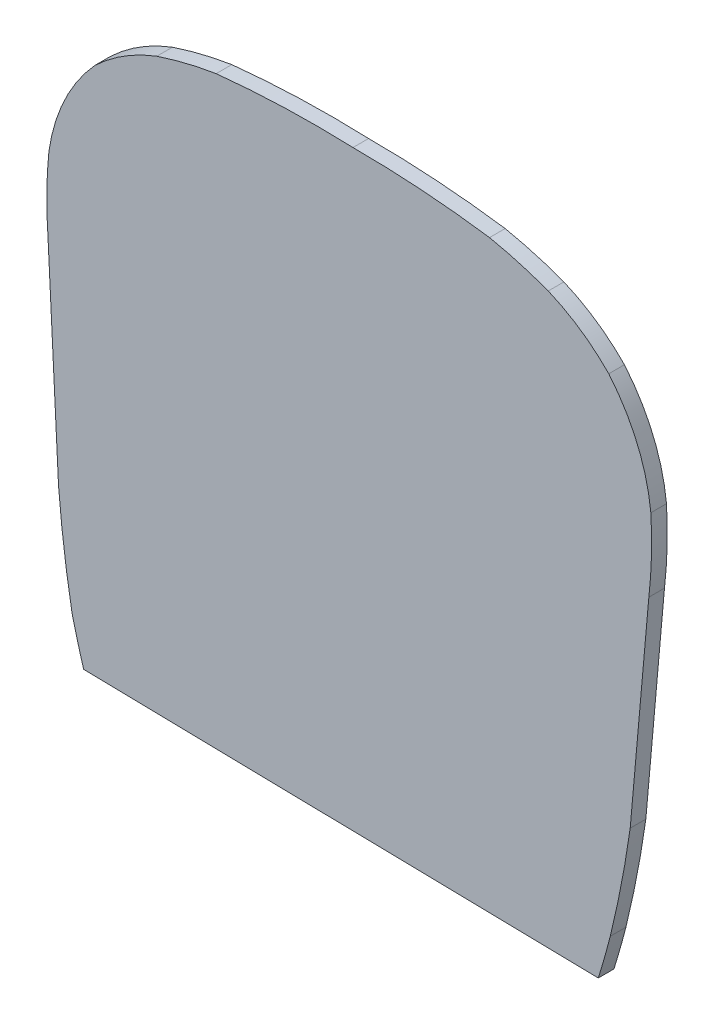
ISO-10303-21;
HEADER;
FILE_DESCRIPTION(('STEP AP214'),'2;1');
FILE_NAME('part.step','',(''),(''),'','','');
FILE_SCHEMA(('AUTOMOTIVE_DESIGN { 1 0 10303 214 1 1 1 1 }'));
ENDSEC;
DATA;
#1=APPLICATION_CONTEXT('core data for automotive mechanical design processes');
#2=APPLICATION_PROTOCOL_DEFINITION('international standard','automotive_design',2000,#1);
#3=PRODUCT_CONTEXT('',#1,'mechanical');
#4=PRODUCT('Part','Part','',(#3));
#5=PRODUCT_RELATED_PRODUCT_CATEGORY('part','',(#4));
#6=PRODUCT_DEFINITION_FORMATION('','',#4);
#7=PRODUCT_DEFINITION_CONTEXT('part definition',#1,'design');
#8=PRODUCT_DEFINITION('design','',#6,#7);
#9=PRODUCT_DEFINITION_SHAPE('','',#8);
#10=(LENGTH_UNIT() NAMED_UNIT(*) SI_UNIT(.MILLI.,.METRE.));
#11=(NAMED_UNIT(*) PLANE_ANGLE_UNIT() SI_UNIT($,.RADIAN.));
#12=(NAMED_UNIT(*) SI_UNIT($,.STERADIAN.) SOLID_ANGLE_UNIT());
#13=UNCERTAINTY_MEASURE_WITH_UNIT(LENGTH_MEASURE(1.E-05),#10,'distance_accuracy_value','');
#14=(GEOMETRIC_REPRESENTATION_CONTEXT(3) GLOBAL_UNCERTAINTY_ASSIGNED_CONTEXT((#13)) GLOBAL_UNIT_ASSIGNED_CONTEXT((#10,
#11,#12)) REPRESENTATION_CONTEXT('',''));
#15=CARTESIAN_POINT('',(0.,0.,0.));
#16=DIRECTION('',(0.,0.,1.));
#17=DIRECTION('',(1.,0.,0.));
#18=AXIS2_PLACEMENT_3D('',#15,#16,#17);
#19=CARTESIAN_POINT('',(-5.67417224383373,6.99934325123754,45.8150965279296));
#20=DIRECTION('',(0.,0.,1.));
#21=DIRECTION('',(-0.999812677663925,0.0193548335692306,0.));
#22=AXIS2_PLACEMENT_3D('',#19,#20,#21);
#23=PLANE('',#22);
#24=CARTESIAN_POINT('',(0.530056286970287,1.01824527478446,45.8150965279299));
#25=DIRECTION('',(0.,0.,-1.));
#26=DIRECTION('',(0.999812677663925,-0.0193548335692306,0.));
#27=AXIS2_PLACEMENT_3D('',#24,#25,#26);
#28=CIRCLE('',#27,12.0325225140272);
#29=CARTESIAN_POINT('',(2.90017532436274,12.8150301672525,45.8150965279298));
#30=VERTEX_POINT('',#29);
#31=CARTESIAN_POINT('',(4.78161682306448,12.2746137415013,45.8150965279299));
#32=VERTEX_POINT('',#31);
#33=EDGE_CURVE('E252',#30,#32,#28,.T.);
#34=ORIENTED_EDGE('',*,*,#33,.F.);
#35=CARTESIAN_POINT('',(-1.48641653317343,-17.9871033769043,45.8150965279301));
#36=DIRECTION('',(0.,0.,-1.));
#37=DIRECTION('',(0.999812677663925,-0.0193548335692306,0.));
#38=AXIS2_PLACEMENT_3D('',#35,#36,#37);
#39=CIRCLE('',#38,31.1129172370042);
#40=CARTESIAN_POINT('',(-1.47338446078643,13.1258111307685,45.8150965279297));
#41=VERTEX_POINT('',#40);
#42=EDGE_CURVE('E248',#41,#30,#39,.T.);
#43=ORIENTED_EDGE('',*,*,#42,.F.);
#44=CARTESIAN_POINT('',(-2.66450711215649,-17.9642973237393,45.8150965279301));
#45=DIRECTION('',(0.,0.,-1.));
#46=DIRECTION('',(0.999812677663925,-0.0193548335692306,0.));
#47=AXIS2_PLACEMENT_3D('',#44,#45,#46);
#48=CIRCLE('',#47,31.1129172030472);
#49=CARTESIAN_POINT('',(-5.85569546522282,12.9845303403083,45.8150965279296));
#50=VERTEX_POINT('',#49);
#51=EDGE_CURVE('E243',#50,#41,#48,.T.);
#52=ORIENTED_EDGE('',*,*,#51,.F.);
#53=CARTESIAN_POINT('',(-3.94391624226271,1.10485449232203,45.8150965279298));
#54=DIRECTION('',(0.,0.,-1.));
#55=DIRECTION('',(0.999812677663925,-0.0193548335692306,0.));
#56=AXIS2_PLACEMENT_3D('',#53,#54,#55);
#57=CIRCLE('',#56,12.0325225140272);
#58=CARTESIAN_POINT('',(-7.75664277320113,12.5173351363735,45.8150965279295));
#59=VERTEX_POINT('',#58);
#60=EDGE_CURVE('E238',#59,#50,#57,.T.);
#61=ORIENTED_EDGE('',*,*,#60,.F.);
#62=CARTESIAN_POINT('',(-5.67417224383373,6.99934325123754,45.8150965279296));
#63=DIRECTION('',(0.,0.,-1.));
#64=DIRECTION('',(0.999812677663925,-0.0193548335692306,0.));
#65=AXIS2_PLACEMENT_3D('',#62,#63,#64);
#66=CIRCLE('',#65,5.8978740195184);
#67=CARTESIAN_POINT('',(-9.74550957704439,11.2665590026749,45.8150965279295));
#68=VERTEX_POINT('',#67);
#69=EDGE_CURVE('E233',#68,#59,#66,.T.);
#70=ORIENTED_EDGE('',*,*,#69,.F.);
#71=CARTESIAN_POINT('',(-5.42512198701847,7.3272075898744,45.8150965279296));
#72=DIRECTION('',(0.,0.,-1.));
#73=DIRECTION('',(0.999812677663925,-0.0193548335692306,0.));
#74=AXIS2_PLACEMENT_3D('',#71,#72,#73);
#75=CIRCLE('',#74,5.846728870196);
#76=CARTESIAN_POINT('',(-11.2152036833306,8.13911425422368,45.8150965279295));
#77=VERTEX_POINT('',#76);
#78=EDGE_CURVE('E228',#77,#68,#75,.T.);
#79=ORIENTED_EDGE('',*,*,#78,.F.);
#80=CARTESIAN_POINT('',(2.30368448001543,6.79226722780302,45.8150965279299));
#81=DIRECTION('',(0.,0.,-1.));
#82=DIRECTION('',(0.999812677663925,-0.0193548335692306,0.));
#83=AXIS2_PLACEMENT_3D('',#80,#81,#82);
#84=CIRCLE('',#83,13.5858137071592);
#85=CARTESIAN_POINT('',(-11.2430688844002,5.76279776767875,45.8150965279295));
#86=VERTEX_POINT('',#85);
#87=EDGE_CURVE('E136',#86,#77,#84,.T.);
#88=ORIENTED_EDGE('',*,*,#87,.F.);
#89=DIRECTION('',(0.0500831809567751,-0.998745050042928,0.));
#90=VECTOR('',#89,1.);
#91=CARTESIAN_POINT('',(-10.9057934577918,-0.963056229434312,45.8150965279296));
#92=LINE('',#91,#90);
#93=CARTESIAN_POINT('',(-10.9057934577918,-0.963056229434231,45.8150965279296));
#94=VERTEX_POINT('',#93);
#95=EDGE_CURVE('E135',#94,#86,#92,.F.);
#96=ORIENTED_EDGE('',*,*,#95,.F.);
#97=CARTESIAN_POINT('',(22.6796627220154,1.7211664776255,45.8150965279306));
#98=DIRECTION('',(0.,0.,-1.));
#99=DIRECTION('',(0.999812677663925,-0.0193548335692306,0.));
#100=AXIS2_PLACEMENT_3D('',#97,#98,#99);
#101=CIRCLE('',#100,33.6925498938096);
#102=CARTESIAN_POINT('',(-10.4707169958812,-4.29882047469555,45.8150965279296));
#103=VERTEX_POINT('',#102);
#104=EDGE_CURVE('E20',#103,#94,#101,.T.);
#105=ORIENTED_EDGE('',*,*,#104,.F.);
#106=CARTESIAN_POINT('',(17.1662588400598,2.46523412556552,45.8150965279304));
#107=DIRECTION('',(0.,0.,-1.));
#108=DIRECTION('',(0.999812677663925,-0.0193548335692306,0.));
#109=AXIS2_PLACEMENT_3D('',#106,#107,#108);
#110=CIRCLE('',#109,28.4526776945808);
#111=CARTESIAN_POINT('',(-10.1003556820076,-5.6641324239686,45.8150965279297));
#112=VERTEX_POINT('',#111);
#113=EDGE_CURVE('E278',#112,#103,#110,.T.);
#114=ORIENTED_EDGE('',*,*,#113,.F.);
#115=DIRECTION('',(0.999812677663925,-0.0193548335692306,0.));
#116=VECTOR('',#115,1.);
#117=CARTESIAN_POINT('',(6.38510731119488,-5.98326559728529,45.8150965279302));
#118=LINE('',#117,#116);
#119=CARTESIAN_POINT('',(6.38510731119487,-5.98326559728529,45.8150965279302));
#120=VERTEX_POINT('',#119);
#121=EDGE_CURVE('E168',#120,#112,#118,.F.);
#122=ORIENTED_EDGE('',*,*,#121,.F.);
#123=CARTESIAN_POINT('',(-20.7843012620732,2.46529083387636,45.8150965279292));
#124=DIRECTION('',(0.,0.,-1.));
#125=DIRECTION('',(0.999812677663925,-0.0193548335692306,0.));
#126=AXIS2_PLACEMENT_3D('',#123,#124,#125);
#127=CIRCLE('',#126,28.4526776945808);
#128=CARTESIAN_POINT('',(6.76871470810026,-4.63303142839532,45.8150965279302));
#129=VERTEX_POINT('',#128);
#130=EDGE_CURVE('E275',#129,#120,#127,.T.);
#131=ORIENTED_EDGE('',*,*,#130,.F.);
#132=CARTESIAN_POINT('',(-25.9566044322497,3.38204221500296,45.8150965279291));
#133=DIRECTION('',(0.,0.,-1.));
#134=DIRECTION('',(0.999812677663925,-0.0193548335692306,0.));
#135=AXIS2_PLACEMENT_3D('',#132,#133,#134);
#136=CIRCLE('',#135,33.6925498938096);
#137=CARTESIAN_POINT('',(7.40687411566913,-1.31542705359407,45.8150965279302));
#138=VERTEX_POINT('',#137);
#139=EDGE_CURVE('E270',#138,#129,#136,.T.);
#140=ORIENTED_EDGE('',*,*,#139,.F.);
#141=DIRECTION('',(0.0886995040357044,0.996058431008854,0.));
#142=VECTOR('',#141,1.);
#143=CARTESIAN_POINT('',(8.00401392218934,5.39020388810814,45.8150965279301));
#144=LINE('',#143,#142);
#145=CARTESIAN_POINT('',(8.00401392218934,5.39020388810806,45.8150965279301));
#146=VERTEX_POINT('',#145);
#147=EDGE_CURVE('E162',#146,#138,#144,.F.);
#148=ORIENTED_EDGE('',*,*,#147,.F.);
#149=CARTESIAN_POINT('',(-5.49274699972552,6.94319413350787,45.8150965279296));
#150=DIRECTION('',(0.,0.,-1.));
#151=DIRECTION('',(0.999812677663925,-0.0193548335692306,0.));
#152=AXIS2_PLACEMENT_3D('',#149,#150,#151);
#153=CIRCLE('',#152,13.5858137071592);
#154=CARTESIAN_POINT('',(8.06813878736105,7.76581844340164,45.8150965279301));
#155=VERTEX_POINT('',#154);
#156=EDGE_CURVE('E267',#155,#146,#153,.T.);
#157=ORIENTED_EDGE('',*,*,#156,.F.);
#158=CARTESIAN_POINT('',(2.25097238178384,7.17861022529906,45.8150965279299));
#159=DIRECTION('',(0.,0.,-1.));
#160=DIRECTION('',(0.999812677663925,-0.0193548335692306,0.));
#161=AXIS2_PLACEMENT_3D('',#158,#159,#160);
#162=CIRCLE('',#161,5.846728870196);
#163=CARTESIAN_POINT('',(6.72058547159109,10.9478007629354,45.81509652793));
#164=VERTEX_POINT('',#163);
#165=EDGE_CURVE('E262',#164,#155,#162,.T.);
#166=ORIENTED_EDGE('',*,*,#165,.F.);
#167=CARTESIAN_POINT('',(2.48714690336352,6.84135268227571,45.8150965279299));
#168=DIRECTION('',(0.,0.,-1.));
#169=DIRECTION('',(0.999812677663925,-0.0193548335692306,0.));
#170=AXIS2_PLACEMENT_3D('',#167,#168,#169);
#171=CIRCLE('',#170,5.8978740195184);
#172=EDGE_CURVE('E257',#32,#164,#171,.T.);
#173=ORIENTED_EDGE('',*,*,#172,.F.);
#174=EDGE_LOOP('',(#34,#43,#52,#61,#70,#79,#88,#96,#105,#114,#122,#131,#140,#148,#157,#166,#173));
#175=FACE_BOUND('',#174,.T.);
#176=ADVANCED_FACE('F17',(#175),#23,.T.);
#177=CARTESIAN_POINT('',(-10.9057934577918,-0.963056229434297,46.8472492910314));
#178=DIRECTION('',(-0.998745050042928,-0.0500831809567751,0.));
#179=DIRECTION('',(0.0500831809567751,-0.998745050042928,0.));
#180=AXIS2_PLACEMENT_3D('',#177,#178,#179);
#181=PLANE('',#180);
#182=DIRECTION('',(0.,0.,-1.));
#183=VECTOR('',#182,1.);
#184=CARTESIAN_POINT('',(-10.9057934577918,-0.963056229434226,46.8472492910314));
#185=LINE('',#184,#183);
#186=CARTESIAN_POINT('',(-10.9057934577918,-0.963056229434252,45.3140965279296));
#187=VERTEX_POINT('',#186);
#188=EDGE_CURVE('E142',#94,#187,#185,.T.);
#189=ORIENTED_EDGE('',*,*,#188,.F.);
#190=ORIENTED_EDGE('',*,*,#95,.T.);
#191=DIRECTION('',(0.,0.,-1.));
#192=VECTOR('',#191,1.);
#193=CARTESIAN_POINT('',(-11.2430688844002,5.76279776767878,46.8472492910314));
#194=LINE('',#193,#192);
#195=CARTESIAN_POINT('',(-11.2430688844002,5.76279776767882,45.3140965279295));
#196=VERTEX_POINT('',#195);
#197=EDGE_CURVE('E227',#196,#86,#194,.F.);
#198=ORIENTED_EDGE('',*,*,#197,.F.);
#199=DIRECTION('',(0.050083180956776,-0.998745050042928,0.));
#200=VECTOR('',#199,1.);
#201=CARTESIAN_POINT('',(-11.2430688844002,5.76279776767876,45.3140965279295));
#202=LINE('',#201,#200);
#203=EDGE_CURVE('E154',#196,#187,#202,.T.);
#204=ORIENTED_EDGE('',*,*,#203,.T.);
#205=EDGE_LOOP('',(#189,#190,#198,#204));
#206=FACE_BOUND('',#205,.T.);
#207=ADVANCED_FACE('F152',(#206),#181,.T.);
#208=CARTESIAN_POINT('',(22.6796627220154,1.72116647762551,46.8472492910325));
#209=DIRECTION('',(0.,0.,-1.));
#210=DIRECTION('',(0.999812677663925,-0.0193548335692306,0.));
#211=AXIS2_PLACEMENT_3D('',#208,#209,#210);
#212=CYLINDRICAL_SURFACE('',#211,33.6925498938096);
#213=DIRECTION('',(0.,0.,-1.));
#214=VECTOR('',#213,1.);
#215=CARTESIAN_POINT('',(-10.4707169958812,-4.29882047469553,46.8472492910315));
#216=LINE('',#215,#214);
#217=CARTESIAN_POINT('',(-10.4707169958812,-4.29882047469555,45.3140965279297));
#218=VERTEX_POINT('',#217);
#219=EDGE_CURVE('E149',#103,#218,#216,.T.);
#220=ORIENTED_EDGE('',*,*,#219,.F.);
#221=ORIENTED_EDGE('',*,*,#104,.T.);
#222=ORIENTED_EDGE('',*,*,#188,.T.);
#223=CARTESIAN_POINT('',(22.6796627220154,1.72116647762549,45.3140965279306));
#224=DIRECTION('',(0.,0.,-1.));
#225=DIRECTION('',(0.999812677663925,-0.0193548335692306,0.));
#226=AXIS2_PLACEMENT_3D('',#223,#224,#225);
#227=CIRCLE('',#226,33.6925498938096);
#228=EDGE_CURVE('E222',#187,#218,#227,.F.);
#229=ORIENTED_EDGE('',*,*,#228,.T.);
#230=EDGE_LOOP('',(#220,#221,#222,#229));
#231=FACE_BOUND('',#230,.T.);
#232=ADVANCED_FACE('F146',(#231),#212,.T.);
#233=CARTESIAN_POINT('',(17.1662588400597,2.46523412556554,46.8472492910323));
#234=DIRECTION('',(0.,0.,-1.));
#235=DIRECTION('',(0.999812677663925,-0.0193548335692306,0.));
#236=AXIS2_PLACEMENT_3D('',#233,#234,#235);
#237=CYLINDRICAL_SURFACE('',#236,28.4526776945808);
#238=DIRECTION('',(0.,0.,1.));
#239=VECTOR('',#238,1.);
#240=CARTESIAN_POINT('',(-10.1003556820076,-5.66413242396858,46.8472492910315));
#241=LINE('',#240,#239);
#242=CARTESIAN_POINT('',(-10.1003556820075,-5.66413242396861,45.3140965279297));
#243=VERTEX_POINT('',#242);
#244=EDGE_CURVE('E172',#112,#243,#241,.F.);
#245=ORIENTED_EDGE('',*,*,#244,.F.);
#246=ORIENTED_EDGE('',*,*,#113,.T.);
#247=ORIENTED_EDGE('',*,*,#219,.T.);
#248=CARTESIAN_POINT('',(17.1662588400598,2.46523412556551,45.3140965279305));
#249=DIRECTION('',(0.,0.,-1.));
#250=DIRECTION('',(0.999812677663925,-0.0193548335692306,0.));
#251=AXIS2_PLACEMENT_3D('',#248,#249,#250);
#252=CIRCLE('',#251,28.4526776945808);
#253=EDGE_CURVE('E218',#218,#243,#252,.F.);
#254=ORIENTED_EDGE('',*,*,#253,.T.);
#255=EDGE_LOOP('',(#245,#246,#247,#254));
#256=FACE_BOUND('',#255,.T.);
#257=ADVANCED_FACE('F286',(#256),#237,.T.);
#258=CARTESIAN_POINT('',(6.38510731119485,-5.98326559728527,46.8472492910321));
#259=DIRECTION('',(-0.0193548335692306,-0.999812677663925,0.));
#260=DIRECTION('',(0.999812677663925,-0.0193548335692306,0.));
#261=AXIS2_PLACEMENT_3D('',#258,#259,#260);
#262=PLANE('',#261);
#263=DIRECTION('',(0.,0.,-1.));
#264=VECTOR('',#263,1.);
#265=CARTESIAN_POINT('',(6.38510731119484,-5.98326559728527,46.8472492910321));
#266=LINE('',#265,#264);
#267=CARTESIAN_POINT('',(6.38510731119489,-5.98326559728529,45.3140965279302));
#268=VERTEX_POINT('',#267);
#269=EDGE_CURVE('E171',#120,#268,#266,.T.);
#270=ORIENTED_EDGE('',*,*,#269,.F.);
#271=ORIENTED_EDGE('',*,*,#121,.T.);
#272=ORIENTED_EDGE('',*,*,#244,.T.);
#273=DIRECTION('',(-0.999812677663925,0.0193548335692306,0.));
#274=VECTOR('',#273,1.);
#275=CARTESIAN_POINT('',(-2.42926960316287,-5.81263283576393,45.3140965279299));
#276=LINE('',#275,#274);
#277=EDGE_CURVE('E217',#243,#268,#276,.F.);
#278=ORIENTED_EDGE('',*,*,#277,.T.);
#279=EDGE_LOOP('',(#270,#271,#272,#278));
#280=FACE_BOUND('',#279,.T.);
#281=ADVANCED_FACE('F332',(#280),#262,.T.);
#282=CARTESIAN_POINT('',(-20.7843012620732,2.46529083387637,46.8472492910311));
#283=DIRECTION('',(0.,0.,-1.));
#284=DIRECTION('',(0.999812677663925,-0.0193548335692306,0.));
#285=AXIS2_PLACEMENT_3D('',#282,#283,#284);
#286=CYLINDRICAL_SURFACE('',#285,28.4526776945808);
#287=DIRECTION('',(0.,0.,-1.));
#288=VECTOR('',#287,1.);
#289=CARTESIAN_POINT('',(6.76871470810022,-4.63303142839535,46.8472492910321));
#290=LINE('',#289,#288);
#291=CARTESIAN_POINT('',(6.76871470810029,-4.63303142839528,45.3140965279302));
#292=VERTEX_POINT('',#291);
#293=EDGE_CURVE('E274',#129,#292,#290,.T.);
#294=ORIENTED_EDGE('',*,*,#293,.F.);
#295=ORIENTED_EDGE('',*,*,#130,.T.);
#296=ORIENTED_EDGE('',*,*,#269,.T.);
#297=CARTESIAN_POINT('',(-20.7843012620732,2.46529083387635,45.3140965279292));
#298=DIRECTION('',(0.,0.,-1.));
#299=DIRECTION('',(0.999812677663925,-0.0193548335692306,0.));
#300=AXIS2_PLACEMENT_3D('',#297,#298,#299);
#301=CIRCLE('',#300,28.4526776945808);
#302=EDGE_CURVE('E213',#268,#292,#301,.F.);
#303=ORIENTED_EDGE('',*,*,#302,.T.);
#304=EDGE_LOOP('',(#294,#295,#296,#303));
#305=FACE_BOUND('',#304,.T.);
#306=ADVANCED_FACE('F331',(#305),#286,.T.);
#307=CARTESIAN_POINT('',(-25.9566044322497,3.38204221500297,46.8472492910309));
#308=DIRECTION('',(0.,0.,-1.));
#309=DIRECTION('',(0.999812677663925,-0.0193548335692306,0.));
#310=AXIS2_PLACEMENT_3D('',#307,#308,#309);
#311=CYLINDRICAL_SURFACE('',#310,33.6925498938096);
#312=DIRECTION('',(0.,0.,1.));
#313=VECTOR('',#312,1.);
#314=CARTESIAN_POINT('',(7.40687411566909,-1.31542705359407,46.847249291032));
#315=LINE('',#314,#313);
#316=CARTESIAN_POINT('',(7.40687411566913,-1.31542705359414,45.3140965279302));
#317=VERTEX_POINT('',#316);
#318=EDGE_CURVE('E167',#138,#317,#315,.F.);
#319=ORIENTED_EDGE('',*,*,#318,.F.);
#320=ORIENTED_EDGE('',*,*,#139,.T.);
#321=ORIENTED_EDGE('',*,*,#293,.T.);
#322=CARTESIAN_POINT('',(-25.9566044322497,3.38204221500295,45.3140965279291));
#323=DIRECTION('',(0.,0.,-1.));
#324=DIRECTION('',(0.999812677663925,-0.0193548335692306,0.));
#325=AXIS2_PLACEMENT_3D('',#322,#323,#324);
#326=CIRCLE('',#325,33.6925498938096);
#327=EDGE_CURVE('E209',#292,#317,#326,.F.);
#328=ORIENTED_EDGE('',*,*,#327,.T.);
#329=EDGE_LOOP('',(#319,#320,#321,#328));
#330=FACE_BOUND('',#329,.T.);
#331=ADVANCED_FACE('F336',(#330),#311,.T.);
#332=CARTESIAN_POINT('',(8.00401392218931,5.39020388810815,46.847249291032));
#333=DIRECTION('',(0.996058431008854,-0.0886995040357044,0.));
#334=DIRECTION('',(0.0886995040357044,0.996058431008854,0.));
#335=AXIS2_PLACEMENT_3D('',#332,#333,#334);
#336=PLANE('',#335);
#337=DIRECTION('',(0.,0.,-1.));
#338=VECTOR('',#337,1.);
#339=CARTESIAN_POINT('',(8.00401392218931,5.39020388810814,46.847249291032));
#340=LINE('',#339,#338);
#341=CARTESIAN_POINT('',(8.00401392218936,5.3902038881081,45.3140965279301));
#342=VERTEX_POINT('',#341);
#343=EDGE_CURVE('E166',#146,#342,#340,.T.);
#344=ORIENTED_EDGE('',*,*,#343,.F.);
#345=ORIENTED_EDGE('',*,*,#147,.T.);
#346=ORIENTED_EDGE('',*,*,#318,.T.);
#347=DIRECTION('',(0.0886995040357049,0.996058431008854,0.));
#348=VECTOR('',#347,1.);
#349=CARTESIAN_POINT('',(7.40687411566913,-1.31542705359416,45.3140965279302));
#350=LINE('',#349,#348);
#351=EDGE_CURVE('E208',#317,#342,#350,.T.);
#352=ORIENTED_EDGE('',*,*,#351,.T.);
#353=EDGE_LOOP('',(#344,#345,#346,#352));
#354=FACE_BOUND('',#353,.T.);
#355=ADVANCED_FACE('F341',(#354),#336,.T.);
#356=CARTESIAN_POINT('',(-5.49274699972555,6.94319413350788,46.8472492910315));
#357=DIRECTION('',(0.,0.,-1.));
#358=DIRECTION('',(0.999812677663925,-0.0193548335692306,0.));
#359=AXIS2_PLACEMENT_3D('',#356,#357,#358);
#360=CYLINDRICAL_SURFACE('',#359,13.5858137071592);
#361=CARTESIAN_POINT('',(-5.4927469997255,6.94319413350786,45.3140965279297));
#362=DIRECTION('',(0.,0.,-1.));
#363=DIRECTION('',(0.999812677663925,-0.0193548335692306,0.));
#364=AXIS2_PLACEMENT_3D('',#361,#362,#363);
#365=CIRCLE('',#364,13.5858137071592);
#366=CARTESIAN_POINT('',(8.06813878736107,7.76581844340164,45.3140965279301));
#367=VERTEX_POINT('',#366);
#368=EDGE_CURVE('E205',#342,#367,#365,.F.);
#369=ORIENTED_EDGE('',*,*,#368,.T.);
#370=DIRECTION('',(0.,0.,-1.));
#371=VECTOR('',#370,1.);
#372=CARTESIAN_POINT('',(8.06813878736102,7.76581844340167,46.8472492910319));
#373=LINE('',#372,#371);
#374=EDGE_CURVE('E266',#155,#367,#373,.T.);
#375=ORIENTED_EDGE('',*,*,#374,.F.);
#376=ORIENTED_EDGE('',*,*,#156,.T.);
#377=ORIENTED_EDGE('',*,*,#343,.T.);
#378=EDGE_LOOP('',(#369,#375,#376,#377));
#379=FACE_BOUND('',#378,.T.);
#380=ADVANCED_FACE('F350',(#379),#360,.T.);
#381=CARTESIAN_POINT('',(2.2509723817838,7.17861022529908,46.8472492910318));
#382=DIRECTION('',(0.,0.,-1.));
#383=DIRECTION('',(0.999812677663925,-0.0193548335692306,0.));
#384=AXIS2_PLACEMENT_3D('',#381,#382,#383);
#385=CYLINDRICAL_SURFACE('',#384,5.846728870196);
#386=DIRECTION('',(0.,0.,-1.));
#387=VECTOR('',#386,1.);
#388=CARTESIAN_POINT('',(6.72058547159106,10.9478007629354,46.8472492910318));
#389=LINE('',#388,#387);
#390=CARTESIAN_POINT('',(6.72058547159111,10.9478007629353,45.31409652793));
#391=VERTEX_POINT('',#390);
#392=EDGE_CURVE('E261',#164,#391,#389,.T.);
#393=ORIENTED_EDGE('',*,*,#392,.F.);
#394=ORIENTED_EDGE('',*,*,#165,.T.);
#395=ORIENTED_EDGE('',*,*,#374,.T.);
#396=CARTESIAN_POINT('',(2.25097238178385,7.17861022529905,45.3140965279299));
#397=DIRECTION('',(0.,0.,-1.));
#398=DIRECTION('',(0.999812677663925,-0.0193548335692306,0.));
#399=AXIS2_PLACEMENT_3D('',#396,#397,#398);
#400=CIRCLE('',#399,5.846728870196);
#401=EDGE_CURVE('E201',#367,#391,#400,.F.);
#402=ORIENTED_EDGE('',*,*,#401,.T.);
#403=EDGE_LOOP('',(#393,#394,#395,#402));
#404=FACE_BOUND('',#403,.T.);
#405=ADVANCED_FACE('F353',(#404),#385,.T.);
#406=CARTESIAN_POINT('',(2.48714690336348,6.84135268227572,46.8472492910318));
#407=DIRECTION('',(0.,0.,-1.));
#408=DIRECTION('',(0.999812677663925,-0.0193548335692306,0.));
#409=AXIS2_PLACEMENT_3D('',#406,#407,#408);
#410=CYLINDRICAL_SURFACE('',#409,5.8978740195184);
#411=DIRECTION('',(0.,0.,-1.));
#412=VECTOR('',#411,1.);
#413=CARTESIAN_POINT('',(4.78161682306445,12.2746137415013,46.8472492910318));
#414=LINE('',#413,#412);
#415=CARTESIAN_POINT('',(4.78161682306451,12.2746137415013,45.3140965279299));
#416=VERTEX_POINT('',#415);
#417=EDGE_CURVE('E256',#32,#416,#414,.T.);
#418=ORIENTED_EDGE('',*,*,#417,.F.);
#419=ORIENTED_EDGE('',*,*,#172,.T.);
#420=ORIENTED_EDGE('',*,*,#392,.T.);
#421=CARTESIAN_POINT('',(2.48714690336353,6.8413526822757,45.3140965279299));
#422=DIRECTION('',(0.,0.,-1.));
#423=DIRECTION('',(0.999812677663925,-0.0193548335692306,0.));
#424=AXIS2_PLACEMENT_3D('',#421,#422,#423);
#425=CIRCLE('',#424,5.8978740195184);
#426=EDGE_CURVE('E197',#391,#416,#425,.F.);
#427=ORIENTED_EDGE('',*,*,#426,.T.);
#428=EDGE_LOOP('',(#418,#419,#420,#427));
#429=FACE_BOUND('',#428,.T.);
#430=ADVANCED_FACE('F356',(#429),#410,.T.);
#431=CARTESIAN_POINT('',(0.530056286970254,1.01824527478447,46.8472492910318));
#432=DIRECTION('',(0.,0.,-1.));
#433=DIRECTION('',(0.999812677663925,-0.0193548335692306,0.));
#434=AXIS2_PLACEMENT_3D('',#431,#432,#433);
#435=CYLINDRICAL_SURFACE('',#434,12.0325225140272);
#436=DIRECTION('',(0.,0.,-1.));
#437=VECTOR('',#436,1.);
#438=CARTESIAN_POINT('',(2.90017532436272,12.8150301672525,46.8472492910317));
#439=LINE('',#438,#437);
#440=CARTESIAN_POINT('',(2.90017532436274,12.8150301672525,45.3140965279298));
#441=VERTEX_POINT('',#440);
#442=EDGE_CURVE('E251',#30,#441,#439,.T.);
#443=ORIENTED_EDGE('',*,*,#442,.F.);
#444=ORIENTED_EDGE('',*,*,#33,.T.);
#445=ORIENTED_EDGE('',*,*,#417,.T.);
#446=CARTESIAN_POINT('',(0.530056286970303,1.01824527478445,45.3140965279299));
#447=DIRECTION('',(0.,0.,-1.));
#448=DIRECTION('',(0.999812677663925,-0.0193548335692306,0.));
#449=AXIS2_PLACEMENT_3D('',#446,#447,#448);
#450=CIRCLE('',#449,12.0325225140272);
#451=EDGE_CURVE('E193',#416,#441,#450,.F.);
#452=ORIENTED_EDGE('',*,*,#451,.T.);
#453=EDGE_LOOP('',(#443,#444,#445,#452));
#454=FACE_BOUND('',#453,.T.);
#455=ADVANCED_FACE('F360',(#454),#435,.T.);
#456=CARTESIAN_POINT('',(-1.48641653317347,-17.9871033769043,46.847249291032));
#457=DIRECTION('',(0.,0.,-1.));
#458=DIRECTION('',(0.999812677663925,-0.0193548335692306,0.));
#459=AXIS2_PLACEMENT_3D('',#456,#457,#458);
#460=CYLINDRICAL_SURFACE('',#459,31.1129172370042);
#461=DIRECTION('',(0.,0.,-1.));
#462=VECTOR('',#461,1.);
#463=CARTESIAN_POINT('',(-1.47338446078647,13.1258111307686,46.8472492910316));
#464=LINE('',#463,#462);
#465=CARTESIAN_POINT('',(-1.47338446078642,13.1258111307685,45.3140965279297));
#466=VERTEX_POINT('',#465);
#467=EDGE_CURVE('E247',#41,#466,#464,.T.);
#468=ORIENTED_EDGE('',*,*,#467,.F.);
#469=ORIENTED_EDGE('',*,*,#42,.T.);
#470=ORIENTED_EDGE('',*,*,#442,.T.);
#471=CARTESIAN_POINT('',(-1.48641653317342,-17.9871033769043,45.3140965279301));
#472=DIRECTION('',(0.,0.,-1.));
#473=DIRECTION('',(0.999812677663925,-0.0193548335692306,0.));
#474=AXIS2_PLACEMENT_3D('',#471,#472,#473);
#475=CIRCLE('',#474,31.1129172370042);
#476=EDGE_CURVE('E189',#441,#466,#475,.F.);
#477=ORIENTED_EDGE('',*,*,#476,.T.);
#478=EDGE_LOOP('',(#468,#469,#470,#477));
#479=FACE_BOUND('',#478,.T.);
#480=ADVANCED_FACE('F366',(#479),#460,.T.);
#481=CARTESIAN_POINT('',(-2.66450711215652,-17.9642973237393,46.8472492910319));
#482=DIRECTION('',(0.,0.,-1.));
#483=DIRECTION('',(0.999812677663925,-0.0193548335692306,0.));
#484=AXIS2_PLACEMENT_3D('',#481,#482,#483);
#485=CYLINDRICAL_SURFACE('',#484,31.1129172030472);
#486=DIRECTION('',(0.,0.,-1.));
#487=VECTOR('',#486,1.);
#488=CARTESIAN_POINT('',(-5.85569546522287,12.9845303403084,46.8472492910314));
#489=LINE('',#488,#487);
#490=CARTESIAN_POINT('',(-5.85569546522282,12.9845303403083,45.3140965279296));
#491=VERTEX_POINT('',#490);
#492=EDGE_CURVE('E242',#50,#491,#489,.T.);
#493=ORIENTED_EDGE('',*,*,#492,.F.);
#494=ORIENTED_EDGE('',*,*,#51,.T.);
#495=ORIENTED_EDGE('',*,*,#467,.T.);
#496=CARTESIAN_POINT('',(-2.66450711215648,-17.9642973237393,45.3140965279301));
#497=DIRECTION('',(0.,0.,-1.));
#498=DIRECTION('',(0.999812677663925,-0.0193548335692306,0.));
#499=AXIS2_PLACEMENT_3D('',#496,#497,#498);
#500=CIRCLE('',#499,31.1129172030472);
#501=EDGE_CURVE('E185',#466,#491,#500,.F.);
#502=ORIENTED_EDGE('',*,*,#501,.T.);
#503=EDGE_LOOP('',(#493,#494,#495,#502));
#504=FACE_BOUND('',#503,.T.);
#505=ADVANCED_FACE('F369',(#504),#485,.T.);
#506=CARTESIAN_POINT('',(-3.94391624226274,1.10485449232204,46.8472492910316));
#507=DIRECTION('',(0.,0.,-1.));
#508=DIRECTION('',(0.999812677663925,-0.0193548335692306,0.));
#509=AXIS2_PLACEMENT_3D('',#506,#507,#508);
#510=CYLINDRICAL_SURFACE('',#509,12.0325225140272);
#511=DIRECTION('',(0.,0.,-1.));
#512=VECTOR('',#511,1.);
#513=CARTESIAN_POINT('',(-7.75664277320116,12.5173351363735,46.8472492910314));
#514=LINE('',#513,#512);
#515=CARTESIAN_POINT('',(-7.75664277320111,12.5173351363735,45.3140965279295));
#516=VERTEX_POINT('',#515);
#517=EDGE_CURVE('E237',#59,#516,#514,.T.);
#518=ORIENTED_EDGE('',*,*,#517,.F.);
#519=ORIENTED_EDGE('',*,*,#60,.T.);
#520=ORIENTED_EDGE('',*,*,#492,.T.);
#521=CARTESIAN_POINT('',(-3.9439162422627,1.10485449232202,45.3140965279298));
#522=DIRECTION('',(0.,0.,-1.));
#523=DIRECTION('',(0.999812677663925,-0.0193548335692306,0.));
#524=AXIS2_PLACEMENT_3D('',#521,#522,#523);
#525=CIRCLE('',#524,12.0325225140272);
#526=EDGE_CURVE('E181',#491,#516,#525,.F.);
#527=ORIENTED_EDGE('',*,*,#526,.T.);
#528=EDGE_LOOP('',(#518,#519,#520,#527));
#529=FACE_BOUND('',#528,.T.);
#530=ADVANCED_FACE('F372',(#529),#510,.T.);
#531=CARTESIAN_POINT('',(-5.67417224383376,6.99934325123756,46.8472492910315));
#532=DIRECTION('',(0.,0.,-1.));
#533=DIRECTION('',(0.999812677663925,-0.0193548335692306,0.));
#534=AXIS2_PLACEMENT_3D('',#531,#532,#533);
#535=CYLINDRICAL_SURFACE('',#534,5.8978740195184);
#536=DIRECTION('',(0.,0.,-1.));
#537=VECTOR('',#536,1.);
#538=CARTESIAN_POINT('',(-9.74550957704442,11.2665590026749,46.8472492910313));
#539=LINE('',#538,#537);
#540=CARTESIAN_POINT('',(-9.74550957704437,11.2665590026749,45.3140965279295));
#541=VERTEX_POINT('',#540);
#542=EDGE_CURVE('E232',#68,#541,#539,.T.);
#543=ORIENTED_EDGE('',*,*,#542,.F.);
#544=ORIENTED_EDGE('',*,*,#69,.T.);
#545=ORIENTED_EDGE('',*,*,#517,.T.);
#546=CARTESIAN_POINT('',(-5.67417224383371,6.99934325123754,45.3140965279296));
#547=DIRECTION('',(0.,0.,-1.));
#548=DIRECTION('',(0.999812677663925,-0.0193548335692306,0.));
#549=AXIS2_PLACEMENT_3D('',#546,#547,#548);
#550=CIRCLE('',#549,5.8978740195184);
#551=EDGE_CURVE('E177',#516,#541,#550,.F.);
#552=ORIENTED_EDGE('',*,*,#551,.T.);
#553=EDGE_LOOP('',(#543,#544,#545,#552));
#554=FACE_BOUND('',#553,.T.);
#555=ADVANCED_FACE('F376',(#554),#535,.T.);
#556=CARTESIAN_POINT('',(-5.4251219870185,7.32720758987442,46.8472492910315));
#557=DIRECTION('',(0.,0.,-1.));
#558=DIRECTION('',(0.999812677663925,-0.0193548335692306,0.));
#559=AXIS2_PLACEMENT_3D('',#556,#557,#558);
#560=CYLINDRICAL_SURFACE('',#559,5.846728870196);
#561=DIRECTION('',(0.,0.,-1.));
#562=VECTOR('',#561,1.);
#563=CARTESIAN_POINT('',(-11.2152036833306,8.13911425422368,46.8472492910313));
#564=LINE('',#563,#562);
#565=CARTESIAN_POINT('',(-11.2152036833306,8.13911425422366,45.3140965279295));
#566=VERTEX_POINT('',#565);
#567=EDGE_CURVE('E35',#77,#566,#564,.T.);
#568=ORIENTED_EDGE('',*,*,#567,.F.);
#569=ORIENTED_EDGE('',*,*,#78,.T.);
#570=ORIENTED_EDGE('',*,*,#542,.T.);
#571=CARTESIAN_POINT('',(-5.42512198701845,7.3272075898744,45.3140965279296));
#572=DIRECTION('',(0.,0.,-1.));
#573=DIRECTION('',(0.999812677663925,-0.0193548335692306,0.));
#574=AXIS2_PLACEMENT_3D('',#571,#572,#573);
#575=CIRCLE('',#574,5.846728870196);
#576=EDGE_CURVE('E27',#541,#566,#575,.F.);
#577=ORIENTED_EDGE('',*,*,#576,.T.);
#578=EDGE_LOOP('',(#568,#569,#570,#577));
#579=FACE_BOUND('',#578,.T.);
#580=ADVANCED_FACE('F378',(#579),#560,.T.);
#581=CARTESIAN_POINT('',(2.30368448001539,6.79226722780303,46.8472492910318));
#582=DIRECTION('',(0.,0.,-1.));
#583=DIRECTION('',(0.999812677663925,-0.0193548335692306,0.));
#584=AXIS2_PLACEMENT_3D('',#581,#582,#583);
#585=CYLINDRICAL_SURFACE('',#584,13.5858137071592);
#586=ORIENTED_EDGE('',*,*,#197,.T.);
#587=ORIENTED_EDGE('',*,*,#87,.T.);
#588=ORIENTED_EDGE('',*,*,#567,.T.);
#589=CARTESIAN_POINT('',(2.30368448001544,6.79226722780301,45.3140965279299));
#590=DIRECTION('',(0.,0.,-1.));
#591=DIRECTION('',(0.999812677663925,-0.0193548335692306,0.));
#592=AXIS2_PLACEMENT_3D('',#589,#590,#591);
#593=CIRCLE('',#592,13.5858137071592);
#594=EDGE_CURVE('E11',#566,#196,#593,.F.);
#595=ORIENTED_EDGE('',*,*,#594,.T.);
#596=EDGE_LOOP('',(#586,#587,#588,#595));
#597=FACE_BOUND('',#596,.T.);
#598=ADVANCED_FACE('F380',(#597),#585,.T.);
#599=CARTESIAN_POINT('',(-2.66450711215648,-17.9642973237393,45.3140965279301));
#600=DIRECTION('',(0.,0.,1.));
#601=DIRECTION('',(-0.999812677663925,0.0193548335692306,0.));
#602=AXIS2_PLACEMENT_3D('',#599,#600,#601);
#603=PLANE('',#602);
#604=ORIENTED_EDGE('',*,*,#576,.F.);
#605=ORIENTED_EDGE('',*,*,#551,.F.);
#606=ORIENTED_EDGE('',*,*,#526,.F.);
#607=ORIENTED_EDGE('',*,*,#501,.F.);
#608=ORIENTED_EDGE('',*,*,#476,.F.);
#609=ORIENTED_EDGE('',*,*,#451,.F.);
#610=ORIENTED_EDGE('',*,*,#426,.F.);
#611=ORIENTED_EDGE('',*,*,#401,.F.);
#612=ORIENTED_EDGE('',*,*,#368,.F.);
#613=ORIENTED_EDGE('',*,*,#351,.F.);
#614=ORIENTED_EDGE('',*,*,#327,.F.);
#615=ORIENTED_EDGE('',*,*,#302,.F.);
#616=ORIENTED_EDGE('',*,*,#277,.F.);
#617=ORIENTED_EDGE('',*,*,#253,.F.);
#618=ORIENTED_EDGE('',*,*,#228,.F.);
#619=ORIENTED_EDGE('',*,*,#203,.F.);
#620=ORIENTED_EDGE('',*,*,#594,.F.);
#621=EDGE_LOOP('',(#604,#605,#606,#607,#608,#609,#610,#611,#612,#613,#614,#615,#616,#617,#618,
#619,#620));
#622=FACE_BOUND('',#621,.T.);
#623=ADVANCED_FACE('F290',(#622),#603,.F.);
#624=CLOSED_SHELL('',(#176,#207,#232,#257,#281,#306,#331,#355,#380,#405,#430,#455,#480,#505,
#530,#555,#580,#598,#623));
#625=MANIFOLD_SOLID_BREP('B1',#624);
#626=ADVANCED_BREP_SHAPE_REPRESENTATION('',(#18,#625),#14);
#627=SHAPE_DEFINITION_REPRESENTATION(#9,#626);
ENDSEC;
END-ISO-10303-21;
